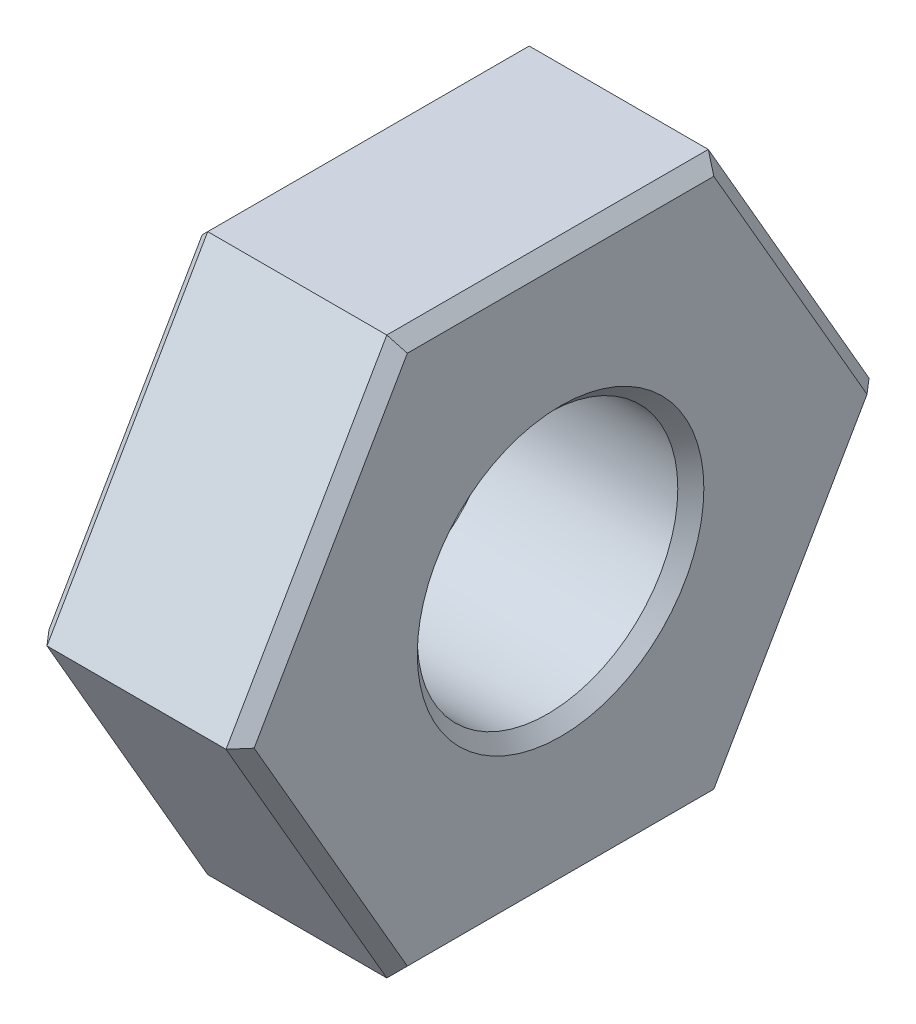
ISO-10303-21;
HEADER;
FILE_DESCRIPTION(('STEP AP214'),'2;1');
FILE_NAME('part.step','',(''),(''),'','','');
FILE_SCHEMA(('AUTOMOTIVE_DESIGN { 1 0 10303 214 1 1 1 1 }'));
ENDSEC;
DATA;
#1=APPLICATION_CONTEXT('core data for automotive mechanical design processes');
#2=APPLICATION_PROTOCOL_DEFINITION('international standard','automotive_design',2000,#1);
#3=PRODUCT_CONTEXT('',#1,'mechanical');
#4=PRODUCT('Part','Part','',(#3));
#5=PRODUCT_RELATED_PRODUCT_CATEGORY('part','',(#4));
#6=PRODUCT_DEFINITION_FORMATION('','',#4);
#7=PRODUCT_DEFINITION_CONTEXT('part definition',#1,'design');
#8=PRODUCT_DEFINITION('design','',#6,#7);
#9=PRODUCT_DEFINITION_SHAPE('','',#8);
#10=(LENGTH_UNIT() NAMED_UNIT(*) SI_UNIT(.MILLI.,.METRE.));
#11=(NAMED_UNIT(*) PLANE_ANGLE_UNIT() SI_UNIT($,.RADIAN.));
#12=(NAMED_UNIT(*) SI_UNIT($,.STERADIAN.) SOLID_ANGLE_UNIT());
#13=UNCERTAINTY_MEASURE_WITH_UNIT(LENGTH_MEASURE(1.E-05),#10,'distance_accuracy_value','');
#14=(GEOMETRIC_REPRESENTATION_CONTEXT(3) GLOBAL_UNCERTAINTY_ASSIGNED_CONTEXT((#13)) GLOBAL_UNIT_ASSIGNED_CONTEXT((#10,
#11,#12)) REPRESENTATION_CONTEXT('',''));
#15=CARTESIAN_POINT('',(0.,0.,0.));
#16=DIRECTION('',(0.,0.,1.));
#17=DIRECTION('',(1.,0.,0.));
#18=AXIS2_PLACEMENT_3D('',#15,#16,#17);
#19=CARTESIAN_POINT('',(3.15,-4.27500000000001,-2.46817240078565));
#20=DIRECTION('',(0.,0.5,0.866025403784439));
#21=DIRECTION('',(0.,-0.866025403784439,0.5));
#22=AXIS2_PLACEMENT_3D('',#19,#20,#21);
#23=PLANE('',#22);
#24=DIRECTION('',(-1.,0.,0.));
#25=VECTOR('',#24,1.);
#26=CARTESIAN_POINT('',(3.15,-4.27500000000001,-2.46817240078565));
#27=LINE('',#26,#25);
#28=CARTESIAN_POINT('',(2.95,-4.27500000000001,-2.46817240078565));
#29=VERTEX_POINT('',#28);
#30=CARTESIAN_POINT('',(0.199999999999999,-4.27500000000001,-2.46817240078565));
#31=VERTEX_POINT('',#30);
#32=EDGE_CURVE('E279',#29,#31,#27,.T.);
#33=ORIENTED_EDGE('',*,*,#32,.T.);
#34=DIRECTION('',(0.,0.866025403784439,-0.5));
#35=VECTOR('',#34,1.);
#36=CARTESIAN_POINT('',(0.199999999999999,-4.27500000000001,-2.46817240078565));
#37=LINE('',#36,#35);
#38=CARTESIAN_POINT('',(0.199999999999999,0.,-4.9363448015713));
#39=VERTEX_POINT('',#38);
#40=EDGE_CURVE('E235',#31,#39,#37,.T.);
#41=ORIENTED_EDGE('',*,*,#40,.T.);
#42=DIRECTION('',(-1.,0.,0.));
#43=VECTOR('',#42,1.);
#44=CARTESIAN_POINT('',(3.15,0.,-4.9363448015713));
#45=LINE('',#44,#43);
#46=CARTESIAN_POINT('',(2.95,0.,-4.9363448015713));
#47=VERTEX_POINT('',#46);
#48=EDGE_CURVE('E166',#47,#39,#45,.T.);
#49=ORIENTED_EDGE('',*,*,#48,.F.);
#50=DIRECTION('',(0.,-0.866025403784439,0.5));
#51=VECTOR('',#50,1.);
#52=CARTESIAN_POINT('',(2.95,-4.27500000000001,-2.46817240078565));
#53=LINE('',#52,#51);
#54=EDGE_CURVE('E232',#47,#29,#53,.T.);
#55=ORIENTED_EDGE('',*,*,#54,.T.);
#56=EDGE_LOOP('',(#33,#41,#49,#55));
#57=FACE_BOUND('',#56,.T.);
#58=ADVANCED_FACE('F39',(#57),#23,.F.);
#59=CARTESIAN_POINT('',(3.15,0.,-4.9363448015713));
#60=DIRECTION('',(0.,-0.5,0.866025403784439));
#61=DIRECTION('',(0.,-0.866025403784439,-0.5));
#62=AXIS2_PLACEMENT_3D('',#59,#60,#61);
#63=PLANE('',#62);
#64=ORIENTED_EDGE('',*,*,#48,.T.);
#65=DIRECTION('',(0.,0.866025403784439,0.5));
#66=VECTOR('',#65,1.);
#67=CARTESIAN_POINT('',(0.199999999999999,0.,-4.9363448015713));
#68=LINE('',#67,#66);
#69=CARTESIAN_POINT('',(0.199999999999999,4.27500000000001,-2.46817240078565));
#70=VERTEX_POINT('',#69);
#71=EDGE_CURVE('E164',#39,#70,#68,.T.);
#72=ORIENTED_EDGE('',*,*,#71,.T.);
#73=DIRECTION('',(-1.,0.,0.));
#74=VECTOR('',#73,1.);
#75=CARTESIAN_POINT('',(3.15,4.27500000000001,-2.46817240078565));
#76=LINE('',#75,#74);
#77=CARTESIAN_POINT('',(2.95,4.27500000000001,-2.46817240078565));
#78=VERTEX_POINT('',#77);
#79=EDGE_CURVE('E145',#78,#70,#76,.T.);
#80=ORIENTED_EDGE('',*,*,#79,.F.);
#81=DIRECTION('',(0.,-0.866025403784439,-0.5));
#82=VECTOR('',#81,1.);
#83=CARTESIAN_POINT('',(2.95,0.,-4.9363448015713));
#84=LINE('',#83,#82);
#85=EDGE_CURVE('E161',#78,#47,#84,.T.);
#86=ORIENTED_EDGE('',*,*,#85,.T.);
#87=EDGE_LOOP('',(#64,#72,#80,#86));
#88=FACE_BOUND('',#87,.T.);
#89=ADVANCED_FACE('F159',(#88),#63,.F.);
#90=CARTESIAN_POINT('',(3.15,4.27500000000001,-2.46817240078565));
#91=DIRECTION('',(0.,-1.,0.));
#92=DIRECTION('',(0.,0.,-1.));
#93=AXIS2_PLACEMENT_3D('',#90,#91,#92);
#94=PLANE('',#93);
#95=ORIENTED_EDGE('',*,*,#79,.T.);
#96=DIRECTION('',(0.,0.,1.));
#97=VECTOR('',#96,1.);
#98=CARTESIAN_POINT('',(0.199999999999999,4.27500000000001,-2.46817240078565));
#99=LINE('',#98,#97);
#100=CARTESIAN_POINT('',(0.199999999999998,4.27500000000001,2.46817240078565));
#101=VERTEX_POINT('',#100);
#102=EDGE_CURVE('E153',#70,#101,#99,.T.);
#103=ORIENTED_EDGE('',*,*,#102,.T.);
#104=DIRECTION('',(-1.,0.,0.));
#105=VECTOR('',#104,1.);
#106=CARTESIAN_POINT('',(3.15,4.27500000000001,2.46817240078565));
#107=LINE('',#106,#105);
#108=CARTESIAN_POINT('',(2.95,4.27500000000001,2.46817240078565));
#109=VERTEX_POINT('',#108);
#110=EDGE_CURVE('E147',#109,#101,#107,.T.);
#111=ORIENTED_EDGE('',*,*,#110,.F.);
#112=DIRECTION('',(0.,0.,-1.));
#113=VECTOR('',#112,1.);
#114=CARTESIAN_POINT('',(2.95,4.27500000000001,-2.46817240078565));
#115=LINE('',#114,#113);
#116=EDGE_CURVE('E142',#109,#78,#115,.T.);
#117=ORIENTED_EDGE('',*,*,#116,.T.);
#118=EDGE_LOOP('',(#95,#103,#111,#117));
#119=FACE_BOUND('',#118,.T.);
#120=ADVANCED_FACE('F144',(#119),#94,.F.);
#121=CARTESIAN_POINT('',(3.15,4.27500000000001,2.46817240078565));
#122=DIRECTION('',(0.,-0.5,-0.866025403784439));
#123=DIRECTION('',(0.,0.866025403784439,-0.5));
#124=AXIS2_PLACEMENT_3D('',#121,#122,#123);
#125=PLANE('',#124);
#126=ORIENTED_EDGE('',*,*,#110,.T.);
#127=DIRECTION('',(0.,-0.866025403784439,0.5));
#128=VECTOR('',#127,1.);
#129=CARTESIAN_POINT('',(0.199999999999998,4.27500000000001,2.46817240078565));
#130=LINE('',#129,#128);
#131=CARTESIAN_POINT('',(0.199999999999998,0.,4.93634480157131));
#132=VERTEX_POINT('',#131);
#133=EDGE_CURVE('E217',#101,#132,#130,.T.);
#134=ORIENTED_EDGE('',*,*,#133,.T.);
#135=DIRECTION('',(-1.,0.,0.));
#136=VECTOR('',#135,1.);
#137=CARTESIAN_POINT('',(3.15,0.,4.93634480157131));
#138=LINE('',#137,#136);
#139=CARTESIAN_POINT('',(2.95,0.,4.93634480157131));
#140=VERTEX_POINT('',#139);
#141=EDGE_CURVE('E299',#140,#132,#138,.T.);
#142=ORIENTED_EDGE('',*,*,#141,.F.);
#143=DIRECTION('',(0.,0.866025403784439,-0.5));
#144=VECTOR('',#143,1.);
#145=CARTESIAN_POINT('',(2.95,4.27500000000001,2.46817240078565));
#146=LINE('',#145,#144);
#147=EDGE_CURVE('E214',#140,#109,#146,.T.);
#148=ORIENTED_EDGE('',*,*,#147,.T.);
#149=EDGE_LOOP('',(#126,#134,#142,#148));
#150=FACE_BOUND('',#149,.T.);
#151=ADVANCED_FACE('F296',(#150),#125,.F.);
#152=CARTESIAN_POINT('',(3.15,0.,4.93634480157131));
#153=DIRECTION('',(0.,0.5,-0.866025403784438));
#154=DIRECTION('',(0.,0.866025403784439,0.5));
#155=AXIS2_PLACEMENT_3D('',#152,#153,#154);
#156=PLANE('',#155);
#157=ORIENTED_EDGE('',*,*,#141,.T.);
#158=DIRECTION('',(0.,-0.866025403784439,-0.5));
#159=VECTOR('',#158,1.);
#160=CARTESIAN_POINT('',(0.199999999999998,0.,4.93634480157131));
#161=LINE('',#160,#159);
#162=CARTESIAN_POINT('',(0.199999999999999,-4.27500000000001,2.46817240078565));
#163=VERTEX_POINT('',#162);
#164=EDGE_CURVE('E222',#132,#163,#161,.T.);
#165=ORIENTED_EDGE('',*,*,#164,.T.);
#166=DIRECTION('',(-1.,0.,0.));
#167=VECTOR('',#166,1.);
#168=CARTESIAN_POINT('',(3.15,-4.27500000000001,2.46817240078565));
#169=LINE('',#168,#167);
#170=CARTESIAN_POINT('',(2.95,-4.27500000000001,2.46817240078565));
#171=VERTEX_POINT('',#170);
#172=EDGE_CURVE('E302',#171,#163,#169,.T.);
#173=ORIENTED_EDGE('',*,*,#172,.F.);
#174=DIRECTION('',(0.,0.866025403784439,0.5));
#175=VECTOR('',#174,1.);
#176=CARTESIAN_POINT('',(2.95,0.,4.93634480157131));
#177=LINE('',#176,#175);
#178=EDGE_CURVE('E219',#171,#140,#177,.T.);
#179=ORIENTED_EDGE('',*,*,#178,.T.);
#180=EDGE_LOOP('',(#157,#165,#173,#179));
#181=FACE_BOUND('',#180,.T.);
#182=ADVANCED_FACE('F343',(#181),#156,.F.);
#183=CARTESIAN_POINT('',(3.15,-4.27500000000001,2.46817240078565));
#184=DIRECTION('',(0.,1.,0.));
#185=DIRECTION('',(0.,0.,1.));
#186=AXIS2_PLACEMENT_3D('',#183,#184,#185);
#187=PLANE('',#186);
#188=ORIENTED_EDGE('',*,*,#172,.T.);
#189=DIRECTION('',(0.,0.,-1.));
#190=VECTOR('',#189,1.);
#191=CARTESIAN_POINT('',(0.199999999999999,-4.27500000000001,2.46817240078565));
#192=LINE('',#191,#190);
#193=EDGE_CURVE('E229',#163,#31,#192,.T.);
#194=ORIENTED_EDGE('',*,*,#193,.T.);
#195=ORIENTED_EDGE('',*,*,#32,.F.);
#196=DIRECTION('',(0.,0.,1.));
#197=VECTOR('',#196,1.);
#198=CARTESIAN_POINT('',(2.95,-4.27500000000001,2.46817240078565));
#199=LINE('',#198,#197);
#200=EDGE_CURVE('E225',#29,#171,#199,.T.);
#201=ORIENTED_EDGE('',*,*,#200,.T.);
#202=EDGE_LOOP('',(#188,#194,#195,#201));
#203=FACE_BOUND('',#202,.T.);
#204=ADVANCED_FACE('F344',(#203),#187,.F.);
#205=CARTESIAN_POINT('',(3.15,0.,0.));
#206=DIRECTION('',(1.,0.,0.));
#207=DIRECTION('',(0.,0.,-1.));
#208=AXIS2_PLACEMENT_3D('',#205,#206,#207);
#209=PLANE('',#208);
#210=DIRECTION('',(0.,-0.866025403784439,-0.5));
#211=VECTOR('',#210,1.);
#212=CARTESIAN_POINT('',(3.15,-4.17500000000001,2.29496732002877));
#213=LINE('',#212,#211);
#214=CARTESIAN_POINT('',(3.15,0.,4.70540469389546));
#215=VERTEX_POINT('',#214);
#216=CARTESIAN_POINT('',(3.15,-4.07500000000001,2.35270234694773));
#217=VERTEX_POINT('',#216);
#218=EDGE_CURVE('E49',#215,#217,#213,.T.);
#219=ORIENTED_EDGE('',*,*,#218,.T.);
#220=DIRECTION('',(0.,0.,-1.));
#221=VECTOR('',#220,1.);
#222=CARTESIAN_POINT('',(3.15,-4.07500000000001,-2.46817240078565));
#223=LINE('',#222,#221);
#224=CARTESIAN_POINT('',(3.15,-4.07500000000001,-2.35270234694773));
#225=VERTEX_POINT('',#224);
#226=EDGE_CURVE('E11',#217,#225,#223,.T.);
#227=ORIENTED_EDGE('',*,*,#226,.T.);
#228=DIRECTION('',(0.,0.866025403784439,-0.5));
#229=VECTOR('',#228,1.);
#230=CARTESIAN_POINT('',(3.15,0.100000000000001,-4.76313972081442));
#231=LINE('',#230,#229);
#232=CARTESIAN_POINT('',(3.15,0.,-4.70540469389546));
#233=VERTEX_POINT('',#232);
#234=EDGE_CURVE('E249',#225,#233,#231,.T.);
#235=ORIENTED_EDGE('',*,*,#234,.T.);
#236=DIRECTION('',(0.,0.866025403784439,0.5));
#237=VECTOR('',#236,1.);
#238=CARTESIAN_POINT('',(3.15,4.17500000000001,-2.29496732002876));
#239=LINE('',#238,#237);
#240=CARTESIAN_POINT('',(3.15,4.07500000000001,-2.35270234694772));
#241=VERTEX_POINT('',#240);
#242=EDGE_CURVE('E252',#233,#241,#239,.T.);
#243=ORIENTED_EDGE('',*,*,#242,.T.);
#244=DIRECTION('',(0.,0.,1.));
#245=VECTOR('',#244,1.);
#246=CARTESIAN_POINT('',(3.15,4.07500000000001,2.46817240078565));
#247=LINE('',#246,#245);
#248=CARTESIAN_POINT('',(3.15,4.07500000000001,2.35270234694773));
#249=VERTEX_POINT('',#248);
#250=EDGE_CURVE('E172',#241,#249,#247,.T.);
#251=ORIENTED_EDGE('',*,*,#250,.T.);
#252=DIRECTION('',(0.,-0.866025403784439,0.5));
#253=VECTOR('',#252,1.);
#254=CARTESIAN_POINT('',(3.15,-0.100000000000003,4.76313972081442));
#255=LINE('',#254,#253);
#256=EDGE_CURVE('E63',#249,#215,#255,.T.);
#257=ORIENTED_EDGE('',*,*,#256,.T.);
#258=EDGE_LOOP('',(#219,#227,#235,#243,#251,#257));
#259=FACE_BOUND('',#258,.T.);
#260=CARTESIAN_POINT('',(3.15,0.,0.));
#261=DIRECTION('',(1.,0.,0.));
#262=DIRECTION('',(0.,0.,-1.));
#263=AXIS2_PLACEMENT_3D('',#260,#261,#262);
#264=CIRCLE('',#263,2.2);
#265=CARTESIAN_POINT('',(3.15,0.,-2.2));
#266=VERTEX_POINT('',#265);
#267=EDGE_CURVE('E245',#266,#266,#264,.F.);
#268=ORIENTED_EDGE('',*,*,#267,.T.);
#269=EDGE_LOOP('',(#268));
#270=FACE_BOUND('',#269,.T.);
#271=ADVANCED_FACE('F352',(#259,#270),#209,.T.);
#272=CARTESIAN_POINT('',(0.,0.,0.));
#273=DIRECTION('',(1.,0.,0.));
#274=DIRECTION('',(0.,0.,-1.));
#275=AXIS2_PLACEMENT_3D('',#272,#273,#274);
#276=PLANE('',#275);
#277=DIRECTION('',(0.,0.,-1.));
#278=VECTOR('',#277,1.);
#279=CARTESIAN_POINT('',(0.,4.07500000000001,0.));
#280=LINE('',#279,#278);
#281=CARTESIAN_POINT('',(0.,4.07500000000001,2.35270234694772));
#282=VERTEX_POINT('',#281);
#283=CARTESIAN_POINT('',(0.,4.07500000000001,-2.35270234694772));
#284=VERTEX_POINT('',#283);
#285=EDGE_CURVE('E206',#282,#284,#280,.T.);
#286=ORIENTED_EDGE('',*,*,#285,.T.);
#287=DIRECTION('',(0.,-0.866025403784439,-0.5));
#288=VECTOR('',#287,1.);
#289=CARTESIAN_POINT('',(0.,2.0375,-3.52905352042159));
#290=LINE('',#289,#288);
#291=CARTESIAN_POINT('',(0.,0.,-4.70540469389545));
#292=VERTEX_POINT('',#291);
#293=EDGE_CURVE('E154',#284,#292,#290,.T.);
#294=ORIENTED_EDGE('',*,*,#293,.T.);
#295=DIRECTION('',(0.,-0.866025403784439,0.5));
#296=VECTOR('',#295,1.);
#297=CARTESIAN_POINT('',(0.,-2.0375,-3.52905352042159));
#298=LINE('',#297,#296);
#299=CARTESIAN_POINT('',(0.,-4.075,-2.35270234694773));
#300=VERTEX_POINT('',#299);
#301=EDGE_CURVE('E195',#292,#300,#298,.T.);
#302=ORIENTED_EDGE('',*,*,#301,.T.);
#303=DIRECTION('',(0.,0.,1.));
#304=VECTOR('',#303,1.);
#305=CARTESIAN_POINT('',(0.,-4.075,0.));
#306=LINE('',#305,#304);
#307=CARTESIAN_POINT('',(0.,-4.075,2.35270234694773));
#308=VERTEX_POINT('',#307);
#309=EDGE_CURVE('E198',#300,#308,#306,.T.);
#310=ORIENTED_EDGE('',*,*,#309,.T.);
#311=DIRECTION('',(0.,0.866025403784439,0.5));
#312=VECTOR('',#311,1.);
#313=CARTESIAN_POINT('',(0.,-2.0375,3.52905352042159));
#314=LINE('',#313,#312);
#315=CARTESIAN_POINT('',(0.,0.,4.70540469389545));
#316=VERTEX_POINT('',#315);
#317=EDGE_CURVE('E201',#308,#316,#314,.T.);
#318=ORIENTED_EDGE('',*,*,#317,.T.);
#319=DIRECTION('',(0.,0.866025403784439,-0.5));
#320=VECTOR('',#319,1.);
#321=CARTESIAN_POINT('',(0.,2.0375,3.52905352042159));
#322=LINE('',#321,#320);
#323=EDGE_CURVE('E204',#316,#282,#322,.T.);
#324=ORIENTED_EDGE('',*,*,#323,.T.);
#325=EDGE_LOOP('',(#286,#294,#302,#310,#318,#324));
#326=FACE_BOUND('',#325,.T.);
#327=CARTESIAN_POINT('',(0.,0.,0.));
#328=DIRECTION('',(1.,0.,0.));
#329=DIRECTION('',(0.,0.,-1.));
#330=AXIS2_PLACEMENT_3D('',#327,#328,#329);
#331=CIRCLE('',#330,2.2);
#332=CARTESIAN_POINT('',(0.,0.,-2.2));
#333=VERTEX_POINT('',#332);
#334=EDGE_CURVE('E187',#333,#333,#331,.T.);
#335=ORIENTED_EDGE('',*,*,#334,.T.);
#336=EDGE_LOOP('',(#335));
#337=FACE_BOUND('',#336,.T.);
#338=ADVANCED_FACE('F355',(#326,#337),#276,.F.);
#339=CARTESIAN_POINT('',(-3.85,0.,0.));
#340=DIRECTION('',(1.,0.,0.));
#341=DIRECTION('',(0.,0.,-1.));
#342=AXIS2_PLACEMENT_3D('',#339,#340,#341);
#343=CYLINDRICAL_SURFACE('',#342,2.);
#344=CARTESIAN_POINT('',(0.200000000000002,0.,0.));
#345=DIRECTION('',(1.,0.,0.));
#346=DIRECTION('',(0.,0.,-1.));
#347=AXIS2_PLACEMENT_3D('',#344,#345,#346);
#348=CIRCLE('',#347,2.);
#349=CARTESIAN_POINT('',(0.200000000000002,0.,-2.));
#350=VERTEX_POINT('',#349);
#351=EDGE_CURVE('E242',#350,#350,#348,.F.);
#352=ORIENTED_EDGE('',*,*,#351,.T.);
#353=EDGE_LOOP('',(#352));
#354=FACE_BOUND('',#353,.T.);
#355=CARTESIAN_POINT('',(2.95,0.,0.));
#356=DIRECTION('',(1.,0.,0.));
#357=DIRECTION('',(0.,0.,-1.));
#358=AXIS2_PLACEMENT_3D('',#355,#356,#357);
#359=CIRCLE('',#358,2.);
#360=CARTESIAN_POINT('',(2.95,0.,-2.));
#361=VERTEX_POINT('',#360);
#362=EDGE_CURVE('E238',#361,#361,#359,.T.);
#363=ORIENTED_EDGE('',*,*,#362,.T.);
#364=EDGE_LOOP('',(#363));
#365=FACE_BOUND('',#364,.T.);
#366=ADVANCED_FACE('F363',(#354,#365),#343,.F.);
#367=CARTESIAN_POINT('',(0.199999999999999,0.,4.93634480157131));
#368=DIRECTION('',(0.707106781186552,0.353553390593272,-0.612372435695791));
#369=DIRECTION('',(0.,-0.866025403784439,-0.5));
#370=AXIS2_PLACEMENT_3D('',#367,#368,#369);
#371=PLANE('',#370);
#372=DIRECTION('',(-0.654653670707974,0.,-0.755928946018458));
#373=VECTOR('',#372,1.);
#374=CARTESIAN_POINT('',(0.199999999999999,0.,4.93634480157131));
#375=LINE('',#374,#373);
#376=EDGE_CURVE('E272',#316,#132,#375,.F.);
#377=ORIENTED_EDGE('',*,*,#376,.F.);
#378=ORIENTED_EDGE('',*,*,#317,.F.);
#379=DIRECTION('',(-0.654653670707973,0.654653670707979,-0.377964473009231));
#380=VECTOR('',#379,1.);
#381=CARTESIAN_POINT('',(0.199999999999999,-4.27500000000001,2.46817240078565));
#382=LINE('',#381,#380);
#383=EDGE_CURVE('E275',#163,#308,#382,.T.);
#384=ORIENTED_EDGE('',*,*,#383,.F.);
#385=ORIENTED_EDGE('',*,*,#164,.F.);
#386=EDGE_LOOP('',(#377,#378,#384,#385));
#387=FACE_BOUND('',#386,.T.);
#388=ADVANCED_FACE('F340',(#387),#371,.F.);
#389=CARTESIAN_POINT('',(0.199999999999999,-4.27500000000001,2.46817240078565));
#390=DIRECTION('',(0.707106781186551,0.707106781186544,0.));
#391=DIRECTION('',(0.,0.,-1.));
#392=AXIS2_PLACEMENT_3D('',#389,#390,#391);
#393=PLANE('',#392);
#394=ORIENTED_EDGE('',*,*,#383,.T.);
#395=ORIENTED_EDGE('',*,*,#309,.F.);
#396=DIRECTION('',(-0.654653670707974,0.654653670707979,0.37796447300923));
#397=VECTOR('',#396,1.);
#398=CARTESIAN_POINT('',(0.199999999999999,-4.27500000000001,-2.46817240078565));
#399=LINE('',#398,#397);
#400=EDGE_CURVE('E269',#31,#300,#399,.T.);
#401=ORIENTED_EDGE('',*,*,#400,.F.);
#402=ORIENTED_EDGE('',*,*,#193,.F.);
#403=EDGE_LOOP('',(#394,#395,#401,#402));
#404=FACE_BOUND('',#403,.T.);
#405=ADVANCED_FACE('F320',(#404),#393,.F.);
#406=CARTESIAN_POINT('',(0.199999999999999,4.27500000000001,2.46817240078565));
#407=DIRECTION('',(0.70710678118655,-0.353553390593272,-0.612372435695792));
#408=DIRECTION('',(0.,-0.866025403784439,0.5));
#409=AXIS2_PLACEMENT_3D('',#406,#407,#408);
#410=PLANE('',#409);
#411=ORIENTED_EDGE('',*,*,#376,.T.);
#412=ORIENTED_EDGE('',*,*,#133,.F.);
#413=DIRECTION('',(-0.654653670707974,-0.654653670707979,-0.37796447300923));
#414=VECTOR('',#413,1.);
#415=CARTESIAN_POINT('',(0.199999999999999,4.27500000000001,2.46817240078565));
#416=LINE('',#415,#414);
#417=EDGE_CURVE('E266',#282,#101,#416,.F.);
#418=ORIENTED_EDGE('',*,*,#417,.F.);
#419=ORIENTED_EDGE('',*,*,#323,.F.);
#420=EDGE_LOOP('',(#411,#412,#418,#419));
#421=FACE_BOUND('',#420,.T.);
#422=ADVANCED_FACE('F336',(#421),#410,.F.);
#423=CARTESIAN_POINT('',(0.199999999999999,-4.27500000000001,-2.46817240078565));
#424=DIRECTION('',(0.707106781186551,0.353553390593272,0.612372435695791));
#425=DIRECTION('',(0.,0.866025403784439,-0.5));
#426=AXIS2_PLACEMENT_3D('',#423,#424,#425);
#427=PLANE('',#426);
#428=ORIENTED_EDGE('',*,*,#400,.T.);
#429=ORIENTED_EDGE('',*,*,#301,.F.);
#430=DIRECTION('',(0.654653670707973,0.,-0.755928946018458));
#431=VECTOR('',#430,1.);
#432=CARTESIAN_POINT('',(-1.02142857142857,0.,-3.52596057255092));
#433=LINE('',#432,#431);
#434=EDGE_CURVE('E263',#39,#292,#433,.F.);
#435=ORIENTED_EDGE('',*,*,#434,.F.);
#436=ORIENTED_EDGE('',*,*,#40,.F.);
#437=EDGE_LOOP('',(#428,#429,#435,#436));
#438=FACE_BOUND('',#437,.T.);
#439=ADVANCED_FACE('F324',(#438),#427,.F.);
#440=CARTESIAN_POINT('',(0.199999999999999,4.27500000000001,-2.46817240078565));
#441=DIRECTION('',(0.70710678118655,-0.707106781186545,0.));
#442=DIRECTION('',(0.,0.,1.));
#443=AXIS2_PLACEMENT_3D('',#440,#441,#442);
#444=PLANE('',#443);
#445=ORIENTED_EDGE('',*,*,#417,.T.);
#446=ORIENTED_EDGE('',*,*,#102,.F.);
#447=DIRECTION('',(-0.654653670707974,-0.654653670707978,0.377964473009231));
#448=VECTOR('',#447,1.);
#449=CARTESIAN_POINT('',(0.199999999999999,4.27500000000001,-2.46817240078565));
#450=LINE('',#449,#448);
#451=EDGE_CURVE('E260',#284,#70,#450,.F.);
#452=ORIENTED_EDGE('',*,*,#451,.F.);
#453=ORIENTED_EDGE('',*,*,#285,.F.);
#454=EDGE_LOOP('',(#445,#446,#452,#453));
#455=FACE_BOUND('',#454,.T.);
#456=ADVANCED_FACE('F332',(#455),#444,.F.);
#457=CARTESIAN_POINT('',(0.199999999999999,0.,-4.9363448015713));
#458=DIRECTION('',(0.707106781186551,-0.353553390593272,0.612372435695791));
#459=DIRECTION('',(0.,0.866025403784439,0.5));
#460=AXIS2_PLACEMENT_3D('',#457,#458,#459);
#461=PLANE('',#460);
#462=ORIENTED_EDGE('',*,*,#434,.T.);
#463=ORIENTED_EDGE('',*,*,#293,.F.);
#464=ORIENTED_EDGE('',*,*,#451,.T.);
#465=ORIENTED_EDGE('',*,*,#71,.F.);
#466=EDGE_LOOP('',(#462,#463,#464,#465));
#467=FACE_BOUND('',#466,.T.);
#468=ADVANCED_FACE('F327',(#467),#461,.F.);
#469=CARTESIAN_POINT('',(0.,0.,0.));
#470=DIRECTION('',(-1.,0.,0.));
#471=DIRECTION('',(0.,0.,1.));
#472=AXIS2_PLACEMENT_3D('',#469,#470,#471);
#473=CONICAL_SURFACE('',#472,2.2,0.785398163397444);
#474=ORIENTED_EDGE('',*,*,#351,.F.);
#475=EDGE_LOOP('',(#474));
#476=FACE_BOUND('',#475,.T.);
#477=ORIENTED_EDGE('',*,*,#334,.F.);
#478=EDGE_LOOP('',(#477));
#479=FACE_BOUND('',#478,.T.);
#480=ADVANCED_FACE('F384',(#476,#479),#473,.F.);
#481=CARTESIAN_POINT('',(3.15,4.07500000000001,0.));
#482=DIRECTION('',(0.707106781186547,0.707106781186548,0.));
#483=DIRECTION('',(0.,0.,-1.));
#484=AXIS2_PLACEMENT_3D('',#481,#482,#483);
#485=PLANE('',#484);
#486=DIRECTION('',(0.654653670707978,-0.654653670707977,0.377964473009227));
#487=VECTOR('',#486,1.);
#488=CARTESIAN_POINT('',(3.73214285714286,3.49285714285716,-2.01660201166948));
#489=LINE('',#488,#487);
#490=EDGE_CURVE('E170',#78,#241,#489,.T.);
#491=ORIENTED_EDGE('',*,*,#490,.F.);
#492=ORIENTED_EDGE('',*,*,#116,.F.);
#493=DIRECTION('',(0.654653670707978,-0.654653670707976,-0.377964473009228));
#494=VECTOR('',#493,1.);
#495=CARTESIAN_POINT('',(3.73214285714286,3.49285714285716,2.01660201166948));
#496=LINE('',#495,#494);
#497=EDGE_CURVE('E43',#249,#109,#496,.F.);
#498=ORIENTED_EDGE('',*,*,#497,.F.);
#499=ORIENTED_EDGE('',*,*,#250,.F.);
#500=EDGE_LOOP('',(#491,#492,#498,#499));
#501=FACE_BOUND('',#500,.T.);
#502=ADVANCED_FACE('F171',(#501),#485,.T.);
#503=CARTESIAN_POINT('',(3.15,2.0375,3.52905352042159));
#504=DIRECTION('',(0.707106781186547,0.353553390593274,0.612372435695795));
#505=DIRECTION('',(0.,0.866025403784439,-0.5));
#506=AXIS2_PLACEMENT_3D('',#503,#504,#505);
#507=PLANE('',#506);
#508=ORIENTED_EDGE('',*,*,#497,.T.);
#509=ORIENTED_EDGE('',*,*,#147,.F.);
#510=DIRECTION('',(0.654653670707978,0.,-0.755928946018454));
#511=VECTOR('',#510,1.);
#512=CARTESIAN_POINT('',(3.73214285714286,0.,4.03320402333896));
#513=LINE('',#512,#511);
#514=EDGE_CURVE('E176',#215,#140,#513,.F.);
#515=ORIENTED_EDGE('',*,*,#514,.F.);
#516=ORIENTED_EDGE('',*,*,#256,.F.);
#517=EDGE_LOOP('',(#508,#509,#515,#516));
#518=FACE_BOUND('',#517,.T.);
#519=ADVANCED_FACE('F293',(#518),#507,.T.);
#520=CARTESIAN_POINT('',(3.15,2.0375,-3.52905352042159));
#521=DIRECTION('',(0.707106781186547,0.353553390593274,-0.612372435695795));
#522=DIRECTION('',(0.,-0.866025403784439,-0.5));
#523=AXIS2_PLACEMENT_3D('',#520,#521,#522);
#524=PLANE('',#523);
#525=ORIENTED_EDGE('',*,*,#490,.T.);
#526=ORIENTED_EDGE('',*,*,#242,.F.);
#527=DIRECTION('',(0.654653670707978,0.,0.755928946018454));
#528=VECTOR('',#527,1.);
#529=CARTESIAN_POINT('',(3.73214285714286,0.,-4.03320402333896));
#530=LINE('',#529,#528);
#531=EDGE_CURVE('E180',#47,#233,#530,.T.);
#532=ORIENTED_EDGE('',*,*,#531,.F.);
#533=ORIENTED_EDGE('',*,*,#85,.F.);
#534=EDGE_LOOP('',(#525,#526,#532,#533));
#535=FACE_BOUND('',#534,.T.);
#536=ADVANCED_FACE('F178',(#535),#524,.T.);
#537=CARTESIAN_POINT('',(3.15,-2.0375,3.52905352042159));
#538=DIRECTION('',(0.707106781186547,-0.353553390593274,0.612372435695795));
#539=DIRECTION('',(0.,0.866025403784439,0.5));
#540=AXIS2_PLACEMENT_3D('',#537,#538,#539);
#541=PLANE('',#540);
#542=ORIENTED_EDGE('',*,*,#514,.T.);
#543=ORIENTED_EDGE('',*,*,#178,.F.);
#544=DIRECTION('',(0.654653670707977,0.654653670707977,-0.377964473009226));
#545=VECTOR('',#544,1.);
#546=CARTESIAN_POINT('',(3.73214285714286,-3.49285714285715,2.01660201166948));
#547=LINE('',#546,#545);
#548=EDGE_CURVE('E282',#217,#171,#547,.F.);
#549=ORIENTED_EDGE('',*,*,#548,.F.);
#550=ORIENTED_EDGE('',*,*,#218,.F.);
#551=EDGE_LOOP('',(#542,#543,#549,#550));
#552=FACE_BOUND('',#551,.T.);
#553=ADVANCED_FACE('F290',(#552),#541,.T.);
#554=CARTESIAN_POINT('',(3.15,-2.0375,-3.52905352042159));
#555=DIRECTION('',(0.707106781186547,-0.353553390593274,-0.612372435695795));
#556=DIRECTION('',(0.,-0.866025403784439,0.5));
#557=AXIS2_PLACEMENT_3D('',#554,#555,#556);
#558=PLANE('',#557);
#559=ORIENTED_EDGE('',*,*,#531,.T.);
#560=ORIENTED_EDGE('',*,*,#234,.F.);
#561=DIRECTION('',(-0.654653670707978,-0.654653670707978,-0.377964473009226));
#562=VECTOR('',#561,1.);
#563=CARTESIAN_POINT('',(3.73214285714286,-3.49285714285715,-2.01660201166948));
#564=LINE('',#563,#562);
#565=EDGE_CURVE('E280',#29,#225,#564,.F.);
#566=ORIENTED_EDGE('',*,*,#565,.F.);
#567=ORIENTED_EDGE('',*,*,#54,.F.);
#568=EDGE_LOOP('',(#559,#560,#566,#567));
#569=FACE_BOUND('',#568,.T.);
#570=ADVANCED_FACE('F351',(#569),#558,.T.);
#571=CARTESIAN_POINT('',(3.15,-4.07500000000001,0.));
#572=DIRECTION('',(0.707106781186548,-0.707106781186548,0.));
#573=DIRECTION('',(0.,0.,1.));
#574=AXIS2_PLACEMENT_3D('',#571,#572,#573);
#575=PLANE('',#574);
#576=ORIENTED_EDGE('',*,*,#548,.T.);
#577=ORIENTED_EDGE('',*,*,#200,.F.);
#578=ORIENTED_EDGE('',*,*,#565,.T.);
#579=ORIENTED_EDGE('',*,*,#226,.F.);
#580=EDGE_LOOP('',(#576,#577,#578,#579));
#581=FACE_BOUND('',#580,.T.);
#582=ADVANCED_FACE('F347',(#581),#575,.T.);
#583=CARTESIAN_POINT('',(2.95,0.,0.));
#584=DIRECTION('',(1.,0.,0.));
#585=DIRECTION('',(0.,0.,-1.));
#586=AXIS2_PLACEMENT_3D('',#583,#584,#585);
#587=CONICAL_SURFACE('',#586,2.,0.785398163397448);
#588=ORIENTED_EDGE('',*,*,#267,.F.);
#589=EDGE_LOOP('',(#588));
#590=FACE_BOUND('',#589,.T.);
#591=ORIENTED_EDGE('',*,*,#362,.F.);
#592=EDGE_LOOP('',(#591));
#593=FACE_BOUND('',#592,.T.);
#594=ADVANCED_FACE('F41',(#590,#593),#587,.F.);
#595=CLOSED_SHELL('',(#58,#89,#120,#151,#182,#204,#271,#338,#366,#388,#405,#422,#439,#456,#468,
#480,#502,#519,#536,#553,#570,#582,#594));
#596=MANIFOLD_SOLID_BREP('B2',#595);
#597=ADVANCED_BREP_SHAPE_REPRESENTATION('',(#18,#596),#14);
#598=SHAPE_DEFINITION_REPRESENTATION(#9,#597);
ENDSEC;
END-ISO-10303-21;
